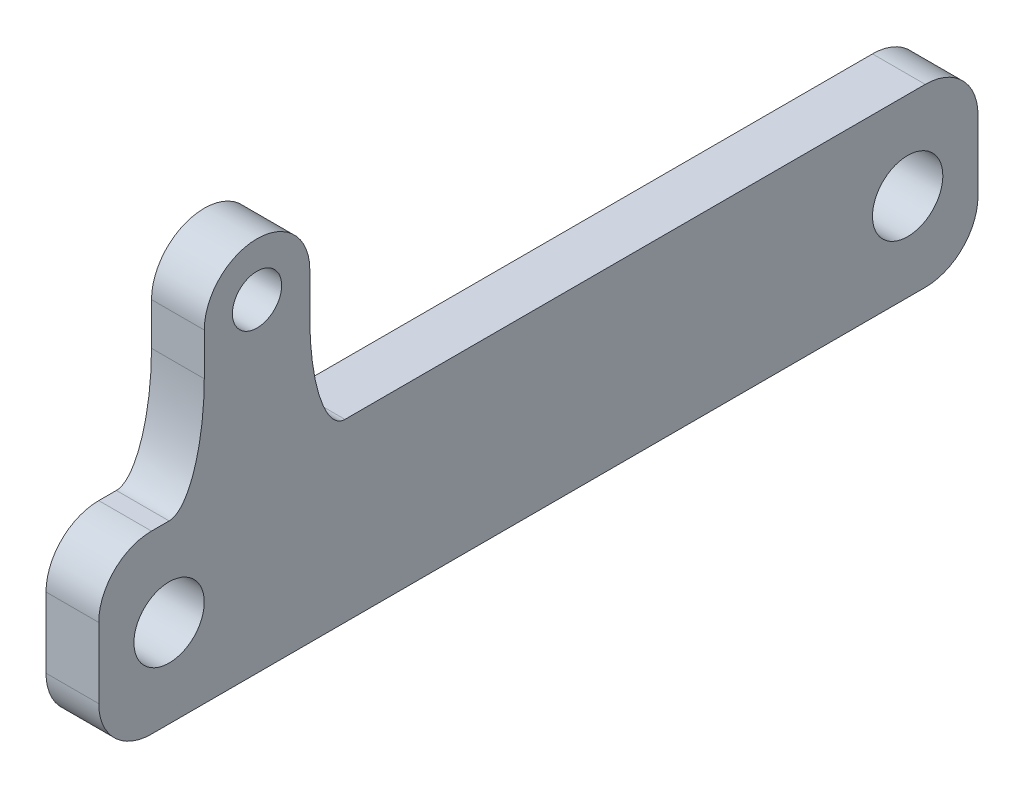
ISO-10303-21;
HEADER;
FILE_DESCRIPTION(('STEP AP214'),'2;1');
FILE_NAME('part.step','',(''),(''),'','','');
FILE_SCHEMA(('AUTOMOTIVE_DESIGN { 1 0 10303 214 1 1 1 1 }'));
ENDSEC;
DATA;
#1=APPLICATION_CONTEXT('core data for automotive mechanical design processes');
#2=APPLICATION_PROTOCOL_DEFINITION('international standard','automotive_design',2000,#1);
#3=PRODUCT_CONTEXT('',#1,'mechanical');
#4=PRODUCT('Part','Part','',(#3));
#5=PRODUCT_RELATED_PRODUCT_CATEGORY('part','',(#4));
#6=PRODUCT_DEFINITION_FORMATION('','',#4);
#7=PRODUCT_DEFINITION_CONTEXT('part definition',#1,'design');
#8=PRODUCT_DEFINITION('design','',#6,#7);
#9=PRODUCT_DEFINITION_SHAPE('','',#8);
#10=(LENGTH_UNIT() NAMED_UNIT(*) SI_UNIT(.MILLI.,.METRE.));
#11=(NAMED_UNIT(*) PLANE_ANGLE_UNIT() SI_UNIT($,.RADIAN.));
#12=(NAMED_UNIT(*) SI_UNIT($,.STERADIAN.) SOLID_ANGLE_UNIT());
#13=UNCERTAINTY_MEASURE_WITH_UNIT(LENGTH_MEASURE(1.E-05),#10,'distance_accuracy_value','');
#14=(GEOMETRIC_REPRESENTATION_CONTEXT(3) GLOBAL_UNCERTAINTY_ASSIGNED_CONTEXT((#13)) GLOBAL_UNIT_ASSIGNED_CONTEXT((#10,
#11,#12)) REPRESENTATION_CONTEXT('',''));
#15=CARTESIAN_POINT('',(0.,0.,0.));
#16=DIRECTION('',(0.,0.,1.));
#17=DIRECTION('',(1.,0.,0.));
#18=AXIS2_PLACEMENT_3D('',#15,#16,#17);
#19=CARTESIAN_POINT('',(61.0000000000004,-7.50000000000028,105.));
#20=DIRECTION('',(0.,-0.999999999999999,0.));
#21=DIRECTION('',(-1.,0.,0.));
#22=AXIS2_PLACEMENT_3D('',#19,#20,#21);
#23=PLANE('',#22);
#24=DIRECTION('',(0.,0.,-0.999999999999999));
#25=VECTOR('',#24,1.);
#26=CARTESIAN_POINT('',(46.0000000000005,-7.50000000000015,105.000000000001));
#27=LINE('',#26,#25);
#28=CARTESIAN_POINT('',(46.0000000000012,-7.49999999999965,35.0000000000026));
#29=VERTEX_POINT('',#28);
#30=CARTESIAN_POINT('',(46.0000000000003,-7.50000000000056,-129.999999999998));
#31=VERTEX_POINT('',#30);
#32=EDGE_CURVE('E189',#29,#31,#27,.T.);
#33=ORIENTED_EDGE('',*,*,#32,.F.);
#34=CARTESIAN_POINT('',(61.7500000000011,-7.50000000000026,35.0000000000006));
#35=CARTESIAN_POINT('',(56.250000000001,-7.50000000000159,35.000000000001));
#36=CARTESIAN_POINT('',(50.750000000001,-7.50000000000078,35.0000000000026));
#37=CARTESIAN_POINT('',(45.2500000000011,-7.4999999999994,35.0000000000026));
#38=(BOUNDED_CURVE() B_SPLINE_CURVE(3,(#34,#35,#36,#37),.UNSPECIFIED.,.F.,
.F.) B_SPLINE_CURVE_WITH_KNOTS((4,4),(0.0636627316607519,0.0801627316607519),
.UNSPECIFIED.) CURVE() GEOMETRIC_REPRESENTATION_ITEM() RATIONAL_B_SPLINE_CURVE((1.,1.,1.,1.)) REPRESENTATION_ITEM(''));
#39=CARTESIAN_POINT('',(61.0000000000011,-7.50000000000056,35.000000000003));
#40=VERTEX_POINT('',#39);
#41=EDGE_CURVE('E300',#40,#29,#38,.T.);
#42=ORIENTED_EDGE('',*,*,#41,.F.);
#43=DIRECTION('',(0.,0.,-0.999999999999999));
#44=VECTOR('',#43,1.);
#45=CARTESIAN_POINT('',(61.0000000000004,-7.50000000000028,105.));
#46=LINE('',#45,#44);
#47=CARTESIAN_POINT('',(61.0000000000004,-7.50000000000081,-129.999999999995));
#48=VERTEX_POINT('',#47);
#49=EDGE_CURVE('E346',#40,#48,#46,.T.);
#50=ORIENTED_EDGE('',*,*,#49,.T.);
#51=DIRECTION('',(1.,0.,0.));
#52=VECTOR('',#51,1.);
#53=CARTESIAN_POINT('',(61.0000000000004,-7.50000000000081,-129.999999999995));
#54=LINE('',#53,#52);
#55=EDGE_CURVE('E302',#31,#48,#54,.T.);
#56=ORIENTED_EDGE('',*,*,#55,.F.);
#57=EDGE_LOOP('',(#33,#42,#50,#56));
#58=FACE_BOUND('',#57,.T.);
#59=ADVANCED_FACE('F40',(#58),#23,.F.);
#60=CARTESIAN_POINT('',(61.0000000000015,-7.50000000000117,90.0000000000003));
#61=VERTEX_POINT('',#60);
#62=CARTESIAN_POINT('',(61.0000000000011,-7.50000000000073,85.));
#63=VERTEX_POINT('',#62);
#64=EDGE_CURVE('E343',#61,#63,#46,.T.);
#65=ORIENTED_EDGE('',*,*,#64,.T.);
#66=CARTESIAN_POINT('',(45.2500000000009,-7.50000000000059,84.9999999999991));
#67=CARTESIAN_POINT('',(50.750000000001,-7.50000000000064,84.9999999999991));
#68=CARTESIAN_POINT('',(56.250000000001,-7.50000000000151,85.0000000000022));
#69=CARTESIAN_POINT('',(61.7500000000009,-7.50000000000053,84.9999999999991));
#70=(BOUNDED_CURVE() B_SPLINE_CURVE(3,(#66,#67,#68,#69),.UNSPECIFIED.,.F.,
.F.) B_SPLINE_CURVE_WITH_KNOTS((4,4),(-0.01575,0.00075),
.UNSPECIFIED.) CURVE() GEOMETRIC_REPRESENTATION_ITEM() RATIONAL_B_SPLINE_CURVE((1.,1.,1.,1.)) REPRESENTATION_ITEM(''));
#71=CARTESIAN_POINT('',(46.000000000001,-7.50000000000059,84.9999999999991));
#72=VERTEX_POINT('',#71);
#73=EDGE_CURVE('E364',#72,#63,#70,.T.);
#74=ORIENTED_EDGE('',*,*,#73,.F.);
#75=CARTESIAN_POINT('',(46.0000000000016,-7.50000000000031,90.0000000000016));
#76=VERTEX_POINT('',#75);
#77=EDGE_CURVE('E304',#76,#72,#27,.T.);
#78=ORIENTED_EDGE('',*,*,#77,.F.);
#79=DIRECTION('',(1.,0.,0.));
#80=VECTOR('',#79,1.);
#81=CARTESIAN_POINT('',(61.0000000000015,-7.50000000000117,90.0000000000003));
#82=LINE('',#81,#80);
#83=EDGE_CURVE('E12',#61,#76,#82,.F.);
#84=ORIENTED_EDGE('',*,*,#83,.F.);
#85=EDGE_LOOP('',(#65,#74,#78,#84));
#86=FACE_BOUND('',#85,.T.);
#87=ADVANCED_FACE('F239',(#86),#23,.F.);
#88=CARTESIAN_POINT('',(61.0000000000004,-7.50000000000028,105.));
#89=DIRECTION('',(-1.,0.,0.));
#90=DIRECTION('',(0.,0.999999999999999,0.));
#91=AXIS2_PLACEMENT_3D('',#88,#89,#90);
#92=PLANE('',#91);
#93=CARTESIAN_POINT('',(61.0000000000007,34.5000000000001,60.0000000000014));
#94=DIRECTION('',(1.,0.,0.));
#95=DIRECTION('',(0.,0.999999999999999,0.));
#96=AXIS2_PLACEMENT_3D('',#93,#94,#95);
#97=CIRCLE('',#96,6.99999999999999);
#98=CARTESIAN_POINT('',(61.0000000000008,41.5,60.0000000000014));
#99=VERTEX_POINT('',#98);
#100=EDGE_CURVE('E631',#99,#99,#97,.T.);
#101=ORIENTED_EDGE('',*,*,#100,.F.);
#102=EDGE_LOOP('',(#101));
#103=FACE_BOUND('',#102,.T.);
#104=CARTESIAN_POINT('',(61.000000000001,-32.5000000000014,84.9999999999999));
#105=DIRECTION('',(1.,0.,0.));
#106=DIRECTION('',(0.,0.999999999999999,0.));
#107=AXIS2_PLACEMENT_3D('',#104,#105,#106);
#108=CIRCLE('',#107,9.99999999999999);
#109=CARTESIAN_POINT('',(61.000000000001,-22.5000000000015,84.9999999999999));
#110=VERTEX_POINT('',#109);
#111=EDGE_CURVE('E638',#110,#110,#108,.T.);
#112=ORIENTED_EDGE('',*,*,#111,.F.);
#113=EDGE_LOOP('',(#112));
#114=FACE_BOUND('',#113,.T.);
#115=CARTESIAN_POINT('',(61.0000000000006,-32.5000000000008,-124.999999999998));
#116=DIRECTION('',(1.,0.,0.));
#117=DIRECTION('',(0.,0.999999999999999,0.));
#118=AXIS2_PLACEMENT_3D('',#115,#116,#117);
#119=CIRCLE('',#118,9.99999999999999);
#120=CARTESIAN_POINT('',(61.0000000000006,-22.5000000000008,-124.999999999998));
#121=VERTEX_POINT('',#120);
#122=EDGE_CURVE('E642',#121,#121,#119,.T.);
#123=ORIENTED_EDGE('',*,*,#122,.F.);
#124=EDGE_LOOP('',(#123));
#125=FACE_BOUND('',#124,.T.);
#126=DIRECTION('',(0.,-0.999999999999999,0.));
#127=VECTOR('',#126,1.);
#128=CARTESIAN_POINT('',(61.0000000000001,-7.50000000000045,-144.999999999999));
#129=LINE('',#128,#127);
#130=CARTESIAN_POINT('',(61.0000000000005,-22.5000000000009,-144.999999999998));
#131=VERTEX_POINT('',#130);
#132=CARTESIAN_POINT('',(61.0000000000009,-42.5000000000009,-144.999999999998));
#133=VERTEX_POINT('',#132);
#134=EDGE_CURVE('E317',#131,#133,#129,.T.);
#135=ORIENTED_EDGE('',*,*,#134,.F.);
#136=CARTESIAN_POINT('',(61.0000000000011,-22.5000000000014,-129.999999999998));
#137=DIRECTION('',(1.,0.,0.));
#138=DIRECTION('',(0.,0.999999999999999,0.));
#139=AXIS2_PLACEMENT_3D('',#136,#137,#138);
#140=CIRCLE('',#139,15.);
#141=EDGE_CURVE('E55',#48,#131,#140,.F.);
#142=ORIENTED_EDGE('',*,*,#141,.F.);
#143=ORIENTED_EDGE('',*,*,#49,.F.);
#144=CARTESIAN_POINT('',(61.0000000000011,22.4999999999986,45.0000000000011));
#145=CARTESIAN_POINT('',(61.0000000000001,-7.5000000000017,45.0000000000009));
#146=CARTESIAN_POINT('',(61.0000000000011,-7.50000000000043,35.0000000000007));
#147=(BOUNDED_CURVE() B_SPLINE_CURVE(2,(#144,#145,#146),.UNSPECIFIED.,.F.,
.F.) B_SPLINE_CURVE_WITH_KNOTS((3,3),(0.,1.),
.UNSPECIFIED.) CURVE() GEOMETRIC_REPRESENTATION_ITEM() RATIONAL_B_SPLINE_CURVE((1.,
0.707106781186548,1.)) REPRESENTATION_ITEM(''));
#148=CARTESIAN_POINT('',(61.000000000001,22.4999999999984,45.0000000000013));
#149=VERTEX_POINT('',#148);
#150=EDGE_CURVE('E223',#149,#40,#147,.T.);
#151=ORIENTED_EDGE('',*,*,#150,.F.);
#152=DIRECTION('',(0.,-0.999999999999999,0.));
#153=VECTOR('',#152,1.);
#154=CARTESIAN_POINT('',(61.0000000000011,-7.50000000000087,45.0000000000007));
#155=LINE('',#154,#153);
#156=CARTESIAN_POINT('',(61.0000000000013,34.4999999999998,45.0000000000006));
#157=VERTEX_POINT('',#156);
#158=EDGE_CURVE('E155',#157,#149,#155,.T.);
#159=ORIENTED_EDGE('',*,*,#158,.F.);
#160=CARTESIAN_POINT('',(61.0000000000007,34.5000000000001,60.0000000000014));
#161=DIRECTION('',(-1.,0.,0.));
#162=DIRECTION('',(0.,0.999999999999999,0.));
#163=AXIS2_PLACEMENT_3D('',#160,#161,#162);
#164=CIRCLE('',#163,15.);
#165=CARTESIAN_POINT('',(61.0000000000012,34.5000000000003,75.0000000000022));
#166=VERTEX_POINT('',#165);
#167=EDGE_CURVE('E147',#166,#157,#164,.T.);
#168=ORIENTED_EDGE('',*,*,#167,.F.);
#169=DIRECTION('',(0.,0.999999999999999,0.));
#170=VECTOR('',#169,1.);
#171=CARTESIAN_POINT('',(61.0000000000012,-7.50000000000148,74.9999999999991));
#172=LINE('',#171,#170);
#173=CARTESIAN_POINT('',(61.0000000000012,22.4999999999989,75.0000000000008));
#174=VERTEX_POINT('',#173);
#175=EDGE_CURVE('E158',#174,#166,#172,.T.);
#176=ORIENTED_EDGE('',*,*,#175,.F.);
#177=CARTESIAN_POINT('',(61.0000000000009,-7.50000000000065,84.9999999999995));
#178=CARTESIAN_POINT('',(60.9999999999993,-7.50000000000066,75.0000000000012));
#179=CARTESIAN_POINT('',(61.0000000000012,22.499999999999,74.9999999999995));
#180=(BOUNDED_CURVE() B_SPLINE_CURVE(2,(#177,#178,#179),.UNSPECIFIED.,.F.,
.F.) B_SPLINE_CURVE_WITH_KNOTS((3,3),(0.,1.),
.UNSPECIFIED.) CURVE() GEOMETRIC_REPRESENTATION_ITEM() RATIONAL_B_SPLINE_CURVE((1.,
0.707106781186547,1.)) REPRESENTATION_ITEM(''));
#181=EDGE_CURVE('E393',#63,#174,#180,.T.);
#182=ORIENTED_EDGE('',*,*,#181,.F.);
#183=ORIENTED_EDGE('',*,*,#64,.F.);
#184=CARTESIAN_POINT('',(61.0000000000012,-22.5000000000003,89.9999999999995));
#185=DIRECTION('',(1.,0.,0.));
#186=DIRECTION('',(0.,0.999999999999999,0.));
#187=AXIS2_PLACEMENT_3D('',#184,#185,#186);
#188=CIRCLE('',#187,15.);
#189=CARTESIAN_POINT('',(61.0000000000011,-22.5000000000013,105.));
#190=VERTEX_POINT('',#189);
#191=EDGE_CURVE('E62',#190,#61,#188,.F.);
#192=ORIENTED_EDGE('',*,*,#191,.F.);
#193=DIRECTION('',(0.,-0.999999999999999,0.));
#194=VECTOR('',#193,1.);
#195=CARTESIAN_POINT('',(61.0000000000004,-7.50000000000028,105.));
#196=LINE('',#195,#194);
#197=CARTESIAN_POINT('',(61.0000000000003,-42.5000000000008,105.000000000002));
#198=VERTEX_POINT('',#197);
#199=EDGE_CURVE('E309',#190,#198,#196,.T.);
#200=ORIENTED_EDGE('',*,*,#199,.T.);
#201=CARTESIAN_POINT('',(61.0000000000004,-42.5000000000009,90.000000000003));
#202=DIRECTION('',(1.,0.,0.));
#203=DIRECTION('',(0.,0.999999999999999,0.));
#204=AXIS2_PLACEMENT_3D('',#201,#202,#203);
#205=CIRCLE('',#204,15.);
#206=CARTESIAN_POINT('',(61.000000000001,-57.5000000000004,90.0000000000016));
#207=VERTEX_POINT('',#206);
#208=EDGE_CURVE('E658',#207,#198,#205,.F.);
#209=ORIENTED_EDGE('',*,*,#208,.F.);
#210=DIRECTION('',(0.,0.,-0.999999999999999));
#211=VECTOR('',#210,1.);
#212=CARTESIAN_POINT('',(61.0000000000011,-57.4999999999995,105.000000000002));
#213=LINE('',#212,#211);
#214=CARTESIAN_POINT('',(61.0000000000002,-57.5000000000006,-129.999999999998));
#215=VERTEX_POINT('',#214);
#216=EDGE_CURVE('E349',#207,#215,#213,.T.);
#217=ORIENTED_EDGE('',*,*,#216,.T.);
#218=CARTESIAN_POINT('',(61.0000000000004,-42.5000000000005,-129.999999999999));
#219=DIRECTION('',(1.,0.,0.));
#220=DIRECTION('',(0.,0.999999999999999,0.));
#221=AXIS2_PLACEMENT_3D('',#218,#219,#220);
#222=CIRCLE('',#221,15.);
#223=EDGE_CURVE('E660',#133,#215,#222,.F.);
#224=ORIENTED_EDGE('',*,*,#223,.F.);
#225=EDGE_LOOP('',(#135,#142,#143,#151,#159,#168,#176,#182,#183,#192,#200,#209,#217,#224));
#226=FACE_BOUND('',#225,.T.);
#227=ADVANCED_FACE('F165',(#103,#114,#125,#226),#92,.F.);
#228=CARTESIAN_POINT('',(46.000000000001,-57.5000000000004,104.999999999999));
#229=DIRECTION('',(0.,0.999999999999999,0.));
#230=DIRECTION('',(1.,0.,0.));
#231=AXIS2_PLACEMENT_3D('',#228,#229,#230);
#232=PLANE('',#231);
#233=ORIENTED_EDGE('',*,*,#216,.F.);
#234=DIRECTION('',(-1.,0.,0.));
#235=VECTOR('',#234,1.);
#236=CARTESIAN_POINT('',(46.0000000000009,-57.5,90.0000000000007));
#237=LINE('',#236,#235);
#238=CARTESIAN_POINT('',(46.0000000000009,-57.5,90.0000000000007));
#239=VERTEX_POINT('',#238);
#240=EDGE_CURVE('E388',#239,#207,#237,.F.);
#241=ORIENTED_EDGE('',*,*,#240,.F.);
#242=DIRECTION('',(0.,0.,-0.999999999999999));
#243=VECTOR('',#242,1.);
#244=CARTESIAN_POINT('',(46.000000000001,-57.5000000000004,104.999999999999));
#245=LINE('',#244,#243);
#246=CARTESIAN_POINT('',(46.0000000000003,-57.5000000000013,-129.999999999999));
#247=VERTEX_POINT('',#246);
#248=EDGE_CURVE('E306',#239,#247,#245,.T.);
#249=ORIENTED_EDGE('',*,*,#248,.T.);
#250=DIRECTION('',(-1.,0.,0.));
#251=VECTOR('',#250,1.);
#252=CARTESIAN_POINT('',(46.0000000000003,-57.5000000000013,-129.999999999999));
#253=LINE('',#252,#251);
#254=EDGE_CURVE('E327',#215,#247,#253,.T.);
#255=ORIENTED_EDGE('',*,*,#254,.F.);
#256=EDGE_LOOP('',(#233,#241,#249,#255));
#257=FACE_BOUND('',#256,.T.);
#258=ADVANCED_FACE('F238',(#257),#232,.F.);
#259=CARTESIAN_POINT('',(46.0000000000005,-7.50000000000015,105.000000000001));
#260=DIRECTION('',(1.,0.,0.));
#261=DIRECTION('',(0.,-0.999999999999999,0.));
#262=AXIS2_PLACEMENT_3D('',#259,#260,#261);
#263=PLANE('',#262);
#264=CARTESIAN_POINT('',(46.0000000000008,34.4999999999991,60.0000000000025));
#265=DIRECTION('',(1.,0.,0.));
#266=DIRECTION('',(0.,0.999999999999999,0.));
#267=AXIS2_PLACEMENT_3D('',#264,#265,#266);
#268=CIRCLE('',#267,6.99999999999999);
#269=CARTESIAN_POINT('',(46.0000000000009,41.499999999999,60.0000000000025));
#270=VERTEX_POINT('',#269);
#271=EDGE_CURVE('E163',#270,#270,#268,.F.);
#272=ORIENTED_EDGE('',*,*,#271,.F.);
#273=EDGE_LOOP('',(#272));
#274=FACE_BOUND('',#273,.T.);
#275=CARTESIAN_POINT('',(46.0000000000011,-32.4999999999987,85.0000000000024));
#276=DIRECTION('',(1.,0.,0.));
#277=DIRECTION('',(0.,0.999999999999999,0.));
#278=AXIS2_PLACEMENT_3D('',#275,#276,#277);
#279=CIRCLE('',#278,9.99999999999999);
#280=CARTESIAN_POINT('',(46.0000000000011,-22.4999999999987,85.0000000000024));
#281=VERTEX_POINT('',#280);
#282=EDGE_CURVE('E635',#281,#281,#279,.F.);
#283=ORIENTED_EDGE('',*,*,#282,.F.);
#284=EDGE_LOOP('',(#283));
#285=FACE_BOUND('',#284,.T.);
#286=CARTESIAN_POINT('',(46.0000000000007,-32.500000000001,-124.999999999998));
#287=DIRECTION('',(1.,0.,0.));
#288=DIRECTION('',(0.,0.999999999999999,0.));
#289=AXIS2_PLACEMENT_3D('',#286,#287,#288);
#290=CIRCLE('',#289,9.99999999999999);
#291=CARTESIAN_POINT('',(46.0000000000007,-22.500000000001,-124.999999999998));
#292=VERTEX_POINT('',#291);
#293=EDGE_CURVE('E377',#292,#292,#290,.F.);
#294=ORIENTED_EDGE('',*,*,#293,.F.);
#295=EDGE_LOOP('',(#294));
#296=FACE_BOUND('',#295,.T.);
#297=ORIENTED_EDGE('',*,*,#248,.F.);
#298=CARTESIAN_POINT('',(46.0000000000003,-42.5000000000004,90.0000000000013));
#299=DIRECTION('',(-1.,0.,0.));
#300=DIRECTION('',(0.,-0.999999999999999,0.));
#301=AXIS2_PLACEMENT_3D('',#298,#299,#300);
#302=CIRCLE('',#301,15.);
#303=CARTESIAN_POINT('',(46.0000000000004,-42.5000000000011,105.000000000001));
#304=VERTEX_POINT('',#303);
#305=EDGE_CURVE('E332',#304,#239,#302,.F.);
#306=ORIENTED_EDGE('',*,*,#305,.F.);
#307=DIRECTION('',(0.,0.999999999999999,0.));
#308=VECTOR('',#307,1.);
#309=CARTESIAN_POINT('',(46.0000000000005,-7.50000000000015,105.000000000001));
#310=LINE('',#309,#308);
#311=CARTESIAN_POINT('',(46.000000000001,-22.5000000000004,104.999999999999));
#312=VERTEX_POINT('',#311);
#313=EDGE_CURVE('E305',#304,#312,#310,.T.);
#314=ORIENTED_EDGE('',*,*,#313,.T.);
#315=CARTESIAN_POINT('',(46.0000000000011,-22.5000000000007,90.0000000000029));
#316=DIRECTION('',(-1.,0.,0.));
#317=DIRECTION('',(0.,-0.999999999999999,0.));
#318=AXIS2_PLACEMENT_3D('',#315,#316,#317);
#319=CIRCLE('',#318,15.);
#320=EDGE_CURVE('E329',#76,#312,#319,.F.);
#321=ORIENTED_EDGE('',*,*,#320,.F.);
#322=ORIENTED_EDGE('',*,*,#77,.T.);
#323=CARTESIAN_POINT('',(46.0000000000012,22.4999999999991,74.9999999999994));
#324=CARTESIAN_POINT('',(45.9999999999993,-7.49999999999895,75.0000000000004));
#325=CARTESIAN_POINT('',(46.0000000000009,-7.5000000000006,84.9999999999991));
#326=(BOUNDED_CURVE() B_SPLINE_CURVE(2,(#323,#324,#325),.UNSPECIFIED.,.F.,
.F.) B_SPLINE_CURVE_WITH_KNOTS((3,3),(0.,1.),
.UNSPECIFIED.) CURVE() GEOMETRIC_REPRESENTATION_ITEM() RATIONAL_B_SPLINE_CURVE((1.,
0.707106781186547,1.)) REPRESENTATION_ITEM(''));
#327=CARTESIAN_POINT('',(46.0000000000013,22.4999999999989,74.9999999999988));
#328=VERTEX_POINT('',#327);
#329=EDGE_CURVE('E259',#328,#72,#326,.T.);
#330=ORIENTED_EDGE('',*,*,#329,.F.);
#331=DIRECTION('',(0.,-0.999999999999999,0.));
#332=VECTOR('',#331,1.);
#333=CARTESIAN_POINT('',(46.0000000000013,-7.50000000000145,74.9999999999991));
#334=LINE('',#333,#332);
#335=CARTESIAN_POINT('',(46.0000000000013,34.5000000000002,75.0000000000022));
#336=VERTEX_POINT('',#335);
#337=EDGE_CURVE('E320',#336,#328,#334,.T.);
#338=ORIENTED_EDGE('',*,*,#337,.F.);
#339=CARTESIAN_POINT('',(46.0000000000008,34.4999999999991,60.0000000000025));
#340=DIRECTION('',(-1.,0.,0.));
#341=DIRECTION('',(0.,-0.999999999999999,0.));
#342=AXIS2_PLACEMENT_3D('',#339,#340,#341);
#343=CIRCLE('',#342,15.);
#344=CARTESIAN_POINT('',(46.0000000000012,34.4999999999991,45.000000000001));
#345=VERTEX_POINT('',#344);
#346=EDGE_CURVE('E150',#345,#336,#343,.F.);
#347=ORIENTED_EDGE('',*,*,#346,.F.);
#348=DIRECTION('',(0.,0.999999999999999,0.));
#349=VECTOR('',#348,1.);
#350=CARTESIAN_POINT('',(46.0000000000012,-7.50000000000067,45.0000000000015));
#351=LINE('',#350,#349);
#352=CARTESIAN_POINT('',(46.0000000000011,22.4999999999988,45.000000000001));
#353=VERTEX_POINT('',#352);
#354=EDGE_CURVE('E178',#353,#345,#351,.T.);
#355=ORIENTED_EDGE('',*,*,#354,.F.);
#356=CARTESIAN_POINT('',(46.0000000000011,-7.49999999999958,35.0000000000026));
#357=CARTESIAN_POINT('',(46.0000000000001,-7.50000000000066,45.0000000000015));
#358=CARTESIAN_POINT('',(46.0000000000011,22.4999999999987,45.0000000000016));
#359=(BOUNDED_CURVE() B_SPLINE_CURVE(2,(#356,#357,#358),.UNSPECIFIED.,.F.,
.F.) B_SPLINE_CURVE_WITH_KNOTS((3,3),(0.,1.),
.UNSPECIFIED.) CURVE() GEOMETRIC_REPRESENTATION_ITEM() RATIONAL_B_SPLINE_CURVE((1.,
0.707106781186548,1.)) REPRESENTATION_ITEM(''));
#360=EDGE_CURVE('E457',#29,#353,#359,.T.);
#361=ORIENTED_EDGE('',*,*,#360,.F.);
#362=ORIENTED_EDGE('',*,*,#32,.T.);
#363=CARTESIAN_POINT('',(46.000000000001,-22.5000000000009,-129.999999999997));
#364=DIRECTION('',(-1.,0.,0.));
#365=DIRECTION('',(0.,-0.999999999999999,0.));
#366=AXIS2_PLACEMENT_3D('',#363,#364,#365);
#367=CIRCLE('',#366,15.);
#368=CARTESIAN_POINT('',(46.0000000000006,-22.5000000000003,-144.999999999999));
#369=VERTEX_POINT('',#368);
#370=EDGE_CURVE('E334',#369,#31,#367,.F.);
#371=ORIENTED_EDGE('',*,*,#370,.F.);
#372=DIRECTION('',(0.,0.999999999999999,0.));
#373=VECTOR('',#372,1.);
#374=CARTESIAN_POINT('',(46.0000000000001,-7.50000000000103,-144.999999999998));
#375=LINE('',#374,#373);
#376=CARTESIAN_POINT('',(46.000000000001,-42.5000000000011,-144.999999999998));
#377=VERTEX_POINT('',#376);
#378=EDGE_CURVE('E314',#377,#369,#375,.T.);
#379=ORIENTED_EDGE('',*,*,#378,.F.);
#380=CARTESIAN_POINT('',(46.0000000000005,-42.5000000000002,-129.999999999998));
#381=DIRECTION('',(-1.,0.,0.));
#382=DIRECTION('',(0.,-0.999999999999999,0.));
#383=AXIS2_PLACEMENT_3D('',#380,#381,#382);
#384=CIRCLE('',#383,15.);
#385=EDGE_CURVE('E336',#247,#377,#384,.F.);
#386=ORIENTED_EDGE('',*,*,#385,.F.);
#387=EDGE_LOOP('',(#297,#306,#314,#321,#322,#330,#338,#347,#355,#361,#362,#371,#379,#386));
#388=FACE_BOUND('',#387,.T.);
#389=ADVANCED_FACE('F264',(#274,#285,#296,#388),#263,.F.);
#390=CARTESIAN_POINT('',(-7.49999999999932,-25.,105.000000000001));
#391=DIRECTION('',(0.,0.,-0.999999999999999));
#392=DIRECTION('',(1.,0.,0.));
#393=AXIS2_PLACEMENT_3D('',#390,#391,#392);
#394=PLANE('',#393);
#395=ORIENTED_EDGE('',*,*,#199,.F.);
#396=DIRECTION('',(1.,0.,0.));
#397=VECTOR('',#396,1.);
#398=CARTESIAN_POINT('',(-7.49999999999932,-22.5000000000007,104.999999999998));
#399=LINE('',#398,#397);
#400=EDGE_CURVE('E655',#312,#190,#399,.T.);
#401=ORIENTED_EDGE('',*,*,#400,.F.);
#402=ORIENTED_EDGE('',*,*,#313,.F.);
#403=DIRECTION('',(-1.,0.,0.));
#404=VECTOR('',#403,1.);
#405=CARTESIAN_POINT('',(-7.49999999999967,-42.5000000000004,105.000000000001));
#406=LINE('',#405,#404);
#407=EDGE_CURVE('E48',#198,#304,#406,.T.);
#408=ORIENTED_EDGE('',*,*,#407,.F.);
#409=EDGE_LOOP('',(#395,#401,#402,#408));
#410=FACE_BOUND('',#409,.T.);
#411=ADVANCED_FACE('F211',(#410),#394,.F.);
#412=CARTESIAN_POINT('',(-7.49999999999932,-25.0000000000008,-144.999999999998));
#413=DIRECTION('',(0.,0.,-0.999999999999999));
#414=DIRECTION('',(1.,0.,0.));
#415=AXIS2_PLACEMENT_3D('',#412,#413,#414);
#416=PLANE('',#415);
#417=ORIENTED_EDGE('',*,*,#378,.T.);
#418=DIRECTION('',(1.,0.,0.));
#419=VECTOR('',#418,1.);
#420=CARTESIAN_POINT('',(46.0000000000006,-22.5000000000003,-144.999999999999));
#421=LINE('',#420,#419);
#422=EDGE_CURVE('E339',#131,#369,#421,.F.);
#423=ORIENTED_EDGE('',*,*,#422,.F.);
#424=ORIENTED_EDGE('',*,*,#134,.T.);
#425=DIRECTION('',(-1.,0.,0.));
#426=VECTOR('',#425,1.);
#427=CARTESIAN_POINT('',(61.0000000000009,-42.5000000000009,-144.999999999998));
#428=LINE('',#427,#426);
#429=EDGE_CURVE('E341',#377,#133,#428,.F.);
#430=ORIENTED_EDGE('',*,*,#429,.F.);
#431=EDGE_LOOP('',(#417,#423,#424,#430));
#432=FACE_BOUND('',#431,.T.);
#433=ADVANCED_FACE('F210',(#432),#416,.T.);
#434=CARTESIAN_POINT('',(-18.4127316607511,-7.5000000000007,75.0000000000011));
#435=DIRECTION('',(0.,0.,0.999999999999999));
#436=DIRECTION('',(0.,-0.999999999999999,0.));
#437=AXIS2_PLACEMENT_3D('',#434,#435,#436);
#438=PLANE('',#437);
#439=ORIENTED_EDGE('',*,*,#175,.T.);
#440=DIRECTION('',(1.,0.,0.));
#441=VECTOR('',#440,1.);
#442=CARTESIAN_POINT('',(-18.4127316607512,34.5,75.0000000000017));
#443=LINE('',#442,#441);
#444=EDGE_CURVE('E143',#336,#166,#443,.T.);
#445=ORIENTED_EDGE('',*,*,#444,.F.);
#446=ORIENTED_EDGE('',*,*,#337,.T.);
#447=CARTESIAN_POINT('',(61.7500000000012,22.4999999999992,74.9999999999995));
#448=CARTESIAN_POINT('',(56.2500000000011,22.4999999999976,74.9999999999995));
#449=CARTESIAN_POINT('',(50.7500000000011,22.499999999999,74.9999999999994));
#450=CARTESIAN_POINT('',(45.2500000000012,22.4999999999991,74.9999999999994));
#451=(BOUNDED_CURVE() B_SPLINE_CURVE(3,(#447,#448,#449,#450),.UNSPECIFIED.,.F.,
.F.) B_SPLINE_CURVE_WITH_KNOTS((4,4),(-0.01575,0.000750000000000001),
.UNSPECIFIED.) CURVE() GEOMETRIC_REPRESENTATION_ITEM() RATIONAL_B_SPLINE_CURVE((1.,1.,1.,1.)) REPRESENTATION_ITEM(''));
#452=EDGE_CURVE('E160',#174,#328,#451,.T.);
#453=ORIENTED_EDGE('',*,*,#452,.F.);
#454=EDGE_LOOP('',(#439,#445,#446,#453));
#455=FACE_BOUND('',#454,.T.);
#456=ADVANCED_FACE('F159',(#455),#438,.T.);
#457=CARTESIAN_POINT('',(-18.4127316607517,34.4999999999985,59.9999999999989));
#458=DIRECTION('',(1.,0.,0.));
#459=DIRECTION('',(0.,-0.999999999999999,0.));
#460=AXIS2_PLACEMENT_3D('',#457,#458,#459);
#461=CYLINDRICAL_SURFACE('',#460,15.);
#462=ORIENTED_EDGE('',*,*,#346,.T.);
#463=ORIENTED_EDGE('',*,*,#444,.T.);
#464=ORIENTED_EDGE('',*,*,#167,.T.);
#465=DIRECTION('',(1.,0.,0.));
#466=VECTOR('',#465,1.);
#467=CARTESIAN_POINT('',(-18.412731660751,34.5,45.0000000000008));
#468=LINE('',#467,#466);
#469=EDGE_CURVE('E154',#345,#157,#468,.T.);
#470=ORIENTED_EDGE('',*,*,#469,.F.);
#471=EDGE_LOOP('',(#462,#463,#464,#470));
#472=FACE_BOUND('',#471,.T.);
#473=ADVANCED_FACE('F145',(#472),#461,.T.);
#474=CARTESIAN_POINT('',(-18.4127316607507,-7.49999999999981,45.0000000000007));
#475=DIRECTION('',(0.,0.,-0.999999999999999));
#476=DIRECTION('',(0.,0.999999999999999,0.));
#477=AXIS2_PLACEMENT_3D('',#474,#475,#476);
#478=PLANE('',#477);
#479=ORIENTED_EDGE('',*,*,#354,.T.);
#480=ORIENTED_EDGE('',*,*,#469,.T.);
#481=ORIENTED_EDGE('',*,*,#158,.T.);
#482=CARTESIAN_POINT('',(45.2500000000011,22.4999999999988,45.0000000000017));
#483=CARTESIAN_POINT('',(50.7500000000012,22.4999999999986,45.0000000000008));
#484=CARTESIAN_POINT('',(56.250000000001,22.499999999998,45.0000000000007));
#485=CARTESIAN_POINT('',(61.750000000001,22.4999999999986,45.0000000000012));
#486=(BOUNDED_CURVE() B_SPLINE_CURVE(3,(#482,#483,#484,#485),.UNSPECIFIED.,.F.,
.F.) B_SPLINE_CURVE_WITH_KNOTS((4,4),(0.0636627316607518,0.0801627316607518),
.UNSPECIFIED.) CURVE() GEOMETRIC_REPRESENTATION_ITEM() RATIONAL_B_SPLINE_CURVE((1.,1.,1.,1.)) REPRESENTATION_ITEM(''));
#487=EDGE_CURVE('E183',#353,#149,#486,.T.);
#488=ORIENTED_EDGE('',*,*,#487,.F.);
#489=EDGE_LOOP('',(#479,#480,#481,#488));
#490=FACE_BOUND('',#489,.T.);
#491=ADVANCED_FACE('F192',(#490),#478,.T.);
#492=CARTESIAN_POINT('',(45.2500000000011,22.4999999999988,45.0000000000017));
#493=CARTESIAN_POINT('',(50.7500000000012,22.4999999999986,45.0000000000008));
#494=CARTESIAN_POINT('',(56.250000000001,22.499999999998,45.0000000000007));
#495=CARTESIAN_POINT('',(61.750000000001,22.4999999999986,45.0000000000012));
#496=CARTESIAN_POINT('',(45.2500000000001,-7.50000000000074,45.0000000000019));
#497=CARTESIAN_POINT('',(50.7500000000002,-7.50000000000011,44.9999999999988));
#498=CARTESIAN_POINT('',(56.2500000000001,-7.50000000000078,44.9999999999992));
#499=CARTESIAN_POINT('',(61.7500000000001,-7.50000000000184,45.0000000000011));
#500=CARTESIAN_POINT('',(45.2500000000011,-7.4999999999994,35.0000000000026));
#501=CARTESIAN_POINT('',(50.750000000001,-7.50000000000078,35.0000000000026));
#502=CARTESIAN_POINT('',(56.250000000001,-7.50000000000159,35.000000000001));
#503=CARTESIAN_POINT('',(61.7500000000011,-7.50000000000026,35.0000000000006));
#504=(BOUNDED_SURFACE() B_SPLINE_SURFACE(2,3,((#492,#493,#494,#495),(#496,#497,#498,#499),(#500,
#501,#502,#503)),.UNSPECIFIED.,.F.,.F.,.F.) B_SPLINE_SURFACE_WITH_KNOTS((3,3),(4,4),(0.,1.),
(0.0636627316607518,0.0801627316607518),
.UNSPECIFIED.) GEOMETRIC_REPRESENTATION_ITEM() RATIONAL_B_SPLINE_SURFACE(((1.,1.,1.,1.),
(0.707106781186548,0.707106781186548,0.707106781186548,0.707106781186548),(1.,1.,1.,1.))) REPRESENTATION_ITEM('') SURFACE());
#505=ORIENTED_EDGE('',*,*,#360,.T.);
#506=ORIENTED_EDGE('',*,*,#487,.T.);
#507=ORIENTED_EDGE('',*,*,#150,.T.);
#508=ORIENTED_EDGE('',*,*,#41,.T.);
#509=EDGE_LOOP('',(#505,#506,#507,#508));
#510=FACE_BOUND('',#509,.T.);
#511=ADVANCED_FACE('F202',(#510),#504,.F.);
#512=CARTESIAN_POINT('',(45.2500000000009,-7.50000000000059,84.9999999999991));
#513=CARTESIAN_POINT('',(50.750000000001,-7.50000000000064,84.9999999999991));
#514=CARTESIAN_POINT('',(56.250000000001,-7.50000000000151,85.0000000000022));
#515=CARTESIAN_POINT('',(61.7500000000009,-7.50000000000053,84.9999999999991));
#516=CARTESIAN_POINT('',(45.2499999999993,-7.4999999999985,75.0000000000003));
#517=CARTESIAN_POINT('',(50.7499999999994,-7.50000000000196,75.0000000000015));
#518=CARTESIAN_POINT('',(56.2499999999992,-7.50000000000168,75.0000000000014));
#519=CARTESIAN_POINT('',(61.7499999999993,-7.50000000000051,75.0000000000012));
#520=CARTESIAN_POINT('',(45.2500000000012,22.4999999999991,74.9999999999994));
#521=CARTESIAN_POINT('',(50.7500000000011,22.499999999999,74.9999999999994));
#522=CARTESIAN_POINT('',(56.2500000000011,22.4999999999976,74.9999999999995));
#523=CARTESIAN_POINT('',(61.7500000000012,22.4999999999992,74.9999999999995));
#524=(BOUNDED_SURFACE() B_SPLINE_SURFACE(2,3,((#512,#513,#514,#515),(#516,#517,#518,#519),(#520,
#521,#522,#523)),.UNSPECIFIED.,.F.,.F.,.F.) B_SPLINE_SURFACE_WITH_KNOTS((3,3),(4,4),(0.,1.),
(-0.01575,0.00075),
.UNSPECIFIED.) GEOMETRIC_REPRESENTATION_ITEM() RATIONAL_B_SPLINE_SURFACE(((1.,1.,1.,1.),
(0.707106781186547,0.707106781186547,0.707106781186547,0.707106781186547),(1.,1.,1.,1.))) REPRESENTATION_ITEM('') SURFACE());
#525=ORIENTED_EDGE('',*,*,#329,.T.);
#526=ORIENTED_EDGE('',*,*,#73,.T.);
#527=ORIENTED_EDGE('',*,*,#181,.T.);
#528=ORIENTED_EDGE('',*,*,#452,.T.);
#529=EDGE_LOOP('',(#525,#526,#527,#528));
#530=FACE_BOUND('',#529,.T.);
#531=ADVANCED_FACE('F399',(#530),#524,.F.);
#532=CARTESIAN_POINT('',(46.0000000000005,-42.5000000000002,-129.999999999998));
#533=DIRECTION('',(1.,0.,0.));
#534=DIRECTION('',(0.,-0.999999999999999,0.));
#535=AXIS2_PLACEMENT_3D('',#532,#533,#534);
#536=CYLINDRICAL_SURFACE('',#535,15.);
#537=ORIENTED_EDGE('',*,*,#223,.T.);
#538=ORIENTED_EDGE('',*,*,#254,.T.);
#539=ORIENTED_EDGE('',*,*,#385,.T.);
#540=ORIENTED_EDGE('',*,*,#429,.T.);
#541=EDGE_LOOP('',(#537,#538,#539,#540));
#542=FACE_BOUND('',#541,.T.);
#543=ADVANCED_FACE('F410',(#542),#536,.T.);
#544=CARTESIAN_POINT('',(61.0000000000011,-22.5000000000014,-129.999999999998));
#545=DIRECTION('',(-1.,0.,0.));
#546=DIRECTION('',(0.,0.999999999999999,0.));
#547=AXIS2_PLACEMENT_3D('',#544,#545,#546);
#548=CYLINDRICAL_SURFACE('',#547,15.);
#549=ORIENTED_EDGE('',*,*,#370,.T.);
#550=ORIENTED_EDGE('',*,*,#55,.T.);
#551=ORIENTED_EDGE('',*,*,#141,.T.);
#552=ORIENTED_EDGE('',*,*,#422,.T.);
#553=EDGE_LOOP('',(#549,#550,#551,#552));
#554=FACE_BOUND('',#553,.T.);
#555=ADVANCED_FACE('F508',(#554),#548,.T.);
#556=CARTESIAN_POINT('',(-7.50000000000006,-42.5000000000002,89.9999999999999));
#557=DIRECTION('',(-1.,0.,0.));
#558=DIRECTION('',(0.,0.999999999999999,0.));
#559=AXIS2_PLACEMENT_3D('',#556,#557,#558);
#560=CYLINDRICAL_SURFACE('',#559,15.);
#561=ORIENTED_EDGE('',*,*,#208,.T.);
#562=ORIENTED_EDGE('',*,*,#407,.T.);
#563=ORIENTED_EDGE('',*,*,#305,.T.);
#564=ORIENTED_EDGE('',*,*,#240,.T.);
#565=EDGE_LOOP('',(#561,#562,#563,#564));
#566=FACE_BOUND('',#565,.T.);
#567=ADVANCED_FACE('F515',(#566),#560,.T.);
#568=CARTESIAN_POINT('',(-7.4999999999994,-22.5000000000015,90.0000000000016));
#569=DIRECTION('',(1.,0.,0.));
#570=DIRECTION('',(0.,-0.999999999999999,0.));
#571=AXIS2_PLACEMENT_3D('',#568,#569,#570);
#572=CYLINDRICAL_SURFACE('',#571,15.);
#573=ORIENTED_EDGE('',*,*,#320,.T.);
#574=ORIENTED_EDGE('',*,*,#400,.T.);
#575=ORIENTED_EDGE('',*,*,#191,.T.);
#576=ORIENTED_EDGE('',*,*,#83,.T.);
#577=EDGE_LOOP('',(#573,#574,#575,#576));
#578=FACE_BOUND('',#577,.T.);
#579=ADVANCED_FACE('F42',(#578),#572,.T.);
#580=CARTESIAN_POINT('',(-61.1009999999998,-32.5000000000018,-124.999999999997));
#581=DIRECTION('',(1.,0.,0.));
#582=DIRECTION('',(0.,0.999999999999999,0.));
#583=AXIS2_PLACEMENT_3D('',#580,#581,#582);
#584=CYLINDRICAL_SURFACE('',#583,9.99999999999999);
#585=ORIENTED_EDGE('',*,*,#122,.T.);
#586=EDGE_LOOP('',(#585));
#587=FACE_BOUND('',#586,.T.);
#588=ORIENTED_EDGE('',*,*,#293,.T.);
#589=EDGE_LOOP('',(#588));
#590=FACE_BOUND('',#589,.T.);
#591=ADVANCED_FACE('F203',(#587,#590),#584,.F.);
#592=CARTESIAN_POINT('',(-61.100999999999,-32.4999999999998,85.0000000000025));
#593=DIRECTION('',(1.,0.,0.));
#594=DIRECTION('',(0.,0.999999999999999,0.));
#595=AXIS2_PLACEMENT_3D('',#592,#593,#594);
#596=CYLINDRICAL_SURFACE('',#595,9.99999999999999);
#597=ORIENTED_EDGE('',*,*,#111,.T.);
#598=EDGE_LOOP('',(#597));
#599=FACE_BOUND('',#598,.T.);
#600=ORIENTED_EDGE('',*,*,#282,.T.);
#601=EDGE_LOOP('',(#600));
#602=FACE_BOUND('',#601,.T.);
#603=ADVANCED_FACE('F532',(#599,#602),#596,.F.);
#604=CARTESIAN_POINT('',(-61.1009999999993,34.4999999999997,60.0000000000021));
#605=DIRECTION('',(1.,0.,0.));
#606=DIRECTION('',(0.,0.999999999999999,0.));
#607=AXIS2_PLACEMENT_3D('',#604,#605,#606);
#608=CYLINDRICAL_SURFACE('',#607,6.99999999999999);
#609=ORIENTED_EDGE('',*,*,#100,.T.);
#610=EDGE_LOOP('',(#609));
#611=FACE_BOUND('',#610,.T.);
#612=ORIENTED_EDGE('',*,*,#271,.T.);
#613=EDGE_LOOP('',(#612));
#614=FACE_BOUND('',#613,.T.);
#615=ADVANCED_FACE('F539',(#611,#614),#608,.F.);
#616=CLOSED_SHELL('',(#59,#87,#227,#258,#389,#411,#433,#456,#473,#491,#511,#531,#543,#555,#567,
#579,#591,#603,#615));
#617=MANIFOLD_SOLID_BREP('B2',#616);
#618=ADVANCED_BREP_SHAPE_REPRESENTATION('',(#18,#617),#14);
#619=SHAPE_DEFINITION_REPRESENTATION(#9,#618);
ENDSEC;
END-ISO-10303-21;
